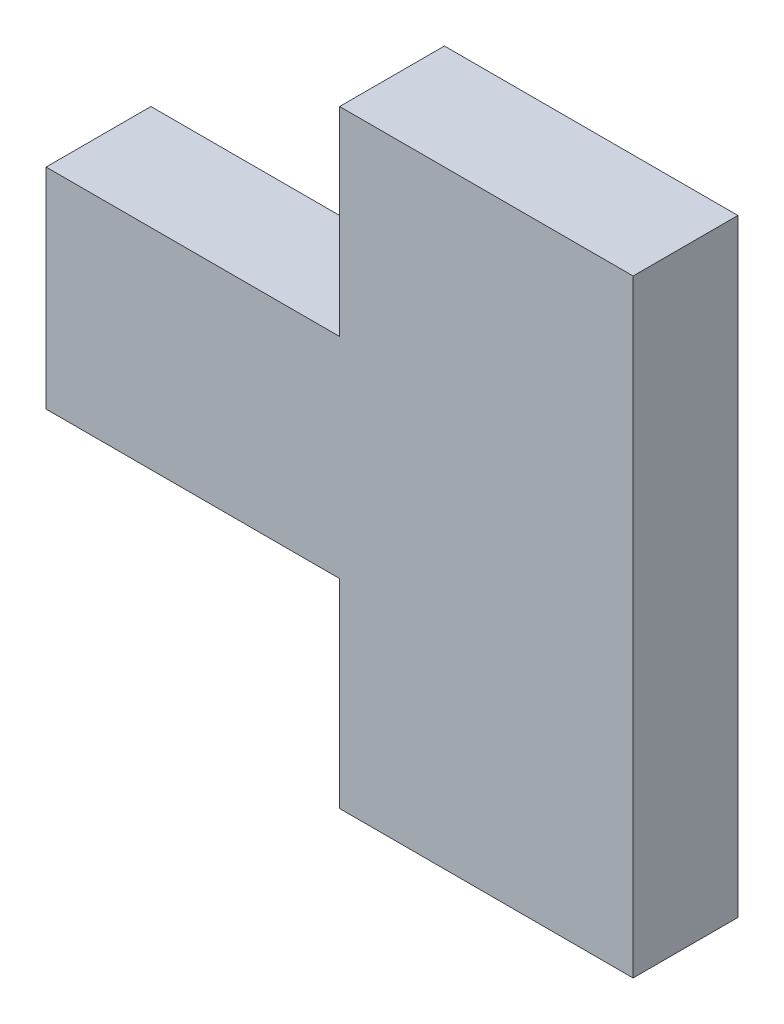
ISO-10303-21;
HEADER;
FILE_DESCRIPTION(('STEP AP214'),'2;1');
FILE_NAME('part.step','',(''),(''),'','','');
FILE_SCHEMA(('AUTOMOTIVE_DESIGN { 1 0 10303 214 1 1 1 1 }'));
ENDSEC;
DATA;
#1=APPLICATION_CONTEXT('core data for automotive mechanical design processes');
#2=APPLICATION_PROTOCOL_DEFINITION('international standard','automotive_design',2000,#1);
#3=PRODUCT_CONTEXT('',#1,'mechanical');
#4=PRODUCT('Part','Part','',(#3));
#5=PRODUCT_RELATED_PRODUCT_CATEGORY('part','',(#4));
#6=PRODUCT_DEFINITION_FORMATION('','',#4);
#7=PRODUCT_DEFINITION_CONTEXT('part definition',#1,'design');
#8=PRODUCT_DEFINITION('design','',#6,#7);
#9=PRODUCT_DEFINITION_SHAPE('','',#8);
#10=(LENGTH_UNIT() NAMED_UNIT(*) SI_UNIT(.MILLI.,.METRE.));
#11=(NAMED_UNIT(*) PLANE_ANGLE_UNIT() SI_UNIT($,.RADIAN.));
#12=(NAMED_UNIT(*) SI_UNIT($,.STERADIAN.) SOLID_ANGLE_UNIT());
#13=UNCERTAINTY_MEASURE_WITH_UNIT(LENGTH_MEASURE(1.E-05),#10,'distance_accuracy_value','');
#14=(GEOMETRIC_REPRESENTATION_CONTEXT(3) GLOBAL_UNCERTAINTY_ASSIGNED_CONTEXT((#13)) GLOBAL_UNIT_ASSIGNED_CONTEXT((#10,
#11,#12)) REPRESENTATION_CONTEXT('',''));
#15=CARTESIAN_POINT('',(0.,0.,0.));
#16=DIRECTION('',(0.,0.,1.));
#17=DIRECTION('',(1.,0.,0.));
#18=AXIS2_PLACEMENT_3D('',#15,#16,#17);
#19=CARTESIAN_POINT('',(-1.39999974,0.50000154,0.5));
#20=DIRECTION('',(0.,0.,-1.));
#21=DIRECTION('',(-1.,0.,0.));
#22=AXIS2_PLACEMENT_3D('',#19,#20,#21);
#23=PLANE('',#22);
#24=DIRECTION('',(-1.,0.,0.));
#25=VECTOR('',#24,1.);
#26=CARTESIAN_POINT('',(-1.39999974,-0.499999,0.5));
#27=LINE('',#26,#25);
#28=CARTESIAN_POINT('',(2.54000000051292E-06,-0.499999,0.5));
#29=VERTEX_POINT('',#28);
#30=CARTESIAN_POINT('',(-1.39999974,-0.499999,0.5));
#31=VERTEX_POINT('',#30);
#32=EDGE_CURVE('E102',#29,#31,#27,.T.);
#33=ORIENTED_EDGE('',*,*,#32,.F.);
#34=DIRECTION('',(0.,1.,0.));
#35=VECTOR('',#34,1.);
#36=CARTESIAN_POINT('',(2.54000000047584E-06,0.50000154,0.5));
#37=LINE('',#36,#35);
#38=CARTESIAN_POINT('',(2.54000000049438E-06,-1.44999964,0.5));
#39=VERTEX_POINT('',#38);
#40=EDGE_CURVE('E79',#39,#29,#37,.T.);
#41=ORIENTED_EDGE('',*,*,#40,.F.);
#42=DIRECTION('',(-1.,0.,0.));
#43=VECTOR('',#42,1.);
#44=CARTESIAN_POINT('',(-1.39999974,-1.44999964,0.5));
#45=LINE('',#44,#43);
#46=CARTESIAN_POINT('',(1.39999974,-1.44999964,0.5));
#47=VERTEX_POINT('',#46);
#48=EDGE_CURVE('E19',#47,#39,#45,.T.);
#49=ORIENTED_EDGE('',*,*,#48,.F.);
#50=DIRECTION('',(0.,1.,0.));
#51=VECTOR('',#50,1.);
#52=CARTESIAN_POINT('',(1.39999974,1.45000218,0.5));
#53=LINE('',#52,#51);
#54=CARTESIAN_POINT('',(1.39999974,1.45000218,0.5));
#55=VERTEX_POINT('',#54);
#56=EDGE_CURVE('E135',#55,#47,#53,.F.);
#57=ORIENTED_EDGE('',*,*,#56,.F.);
#58=DIRECTION('',(1.,0.,0.));
#59=VECTOR('',#58,1.);
#60=CARTESIAN_POINT('',(2.54000000055E-06,1.45000218,0.5));
#61=LINE('',#60,#59);
#62=CARTESIAN_POINT('',(2.54000000053146E-06,1.45000218,0.5));
#63=VERTEX_POINT('',#62);
#64=EDGE_CURVE('E128',#63,#55,#61,.T.);
#65=ORIENTED_EDGE('',*,*,#64,.F.);
#66=DIRECTION('',(0.,1.,0.));
#67=VECTOR('',#66,1.);
#68=CARTESIAN_POINT('',(2.54000000055E-06,0.50000154,0.5));
#69=LINE('',#68,#67);
#70=CARTESIAN_POINT('',(2.54000000049438E-06,0.50000154,0.5));
#71=VERTEX_POINT('',#70);
#72=EDGE_CURVE('E121',#71,#63,#69,.T.);
#73=ORIENTED_EDGE('',*,*,#72,.F.);
#74=DIRECTION('',(1.,0.,0.));
#75=VECTOR('',#74,1.);
#76=CARTESIAN_POINT('',(-1.39999974,0.50000154,0.5));
#77=LINE('',#76,#75);
#78=CARTESIAN_POINT('',(-1.39999974,0.50000154,0.5));
#79=VERTEX_POINT('',#78);
#80=EDGE_CURVE('E114',#79,#71,#77,.T.);
#81=ORIENTED_EDGE('',*,*,#80,.F.);
#82=DIRECTION('',(0.,1.,0.));
#83=VECTOR('',#82,1.);
#84=CARTESIAN_POINT('',(-1.39999974,0.50000154,0.5));
#85=LINE('',#84,#83);
#86=EDGE_CURVE('E109',#31,#79,#85,.T.);
#87=ORIENTED_EDGE('',*,*,#86,.F.);
#88=EDGE_LOOP('',(#33,#41,#49,#57,#65,#73,#81,#87));
#89=FACE_BOUND('',#88,.T.);
#90=ADVANCED_FACE('F16',(#89),#23,.F.);
#91=CARTESIAN_POINT('',(-1.39999974,0.50000154,0.));
#92=DIRECTION('',(0.,1.,0.));
#93=DIRECTION('',(0.,0.,1.));
#94=AXIS2_PLACEMENT_3D('',#91,#92,#93);
#95=PLANE('',#94);
#96=DIRECTION('',(0.,0.,1.));
#97=VECTOR('',#96,1.);
#98=CARTESIAN_POINT('',(2.54000000055E-06,0.50000154,0.));
#99=LINE('',#98,#97);
#100=CARTESIAN_POINT('',(2.54000000049438E-06,0.50000154,0.));
#101=VERTEX_POINT('',#100);
#102=EDGE_CURVE('E117',#101,#71,#99,.T.);
#103=ORIENTED_EDGE('',*,*,#102,.F.);
#104=DIRECTION('',(-1.,0.,0.));
#105=VECTOR('',#104,1.);
#106=CARTESIAN_POINT('',(-1.39999974,0.50000154,0.));
#107=LINE('',#106,#105);
#108=CARTESIAN_POINT('',(-1.39999974,0.50000154,0.));
#109=VERTEX_POINT('',#108);
#110=EDGE_CURVE('E147',#109,#101,#107,.F.);
#111=ORIENTED_EDGE('',*,*,#110,.F.);
#112=DIRECTION('',(0.,0.,1.));
#113=VECTOR('',#112,1.);
#114=CARTESIAN_POINT('',(-1.39999974,0.50000154,0.));
#115=LINE('',#114,#113);
#116=EDGE_CURVE('E143',#79,#109,#115,.F.);
#117=ORIENTED_EDGE('',*,*,#116,.F.);
#118=ORIENTED_EDGE('',*,*,#80,.T.);
#119=EDGE_LOOP('',(#103,#111,#117,#118));
#120=FACE_BOUND('',#119,.T.);
#121=ADVANCED_FACE('F180',(#120),#95,.T.);
#122=CARTESIAN_POINT('',(2.54000000055E-06,0.50000154,0.));
#123=DIRECTION('',(-1.,0.,0.));
#124=DIRECTION('',(0.,0.,1.));
#125=AXIS2_PLACEMENT_3D('',#122,#123,#124);
#126=PLANE('',#125);
#127=DIRECTION('',(0.,0.,1.));
#128=VECTOR('',#127,1.);
#129=CARTESIAN_POINT('',(2.54000000055E-06,1.45000218,0.));
#130=LINE('',#129,#128);
#131=CARTESIAN_POINT('',(2.54000000053146E-06,1.45000218,0.));
#132=VERTEX_POINT('',#131);
#133=EDGE_CURVE('E124',#132,#63,#130,.T.);
#134=ORIENTED_EDGE('',*,*,#133,.F.);
#135=DIRECTION('',(0.,1.,0.));
#136=VECTOR('',#135,1.);
#137=CARTESIAN_POINT('',(2.54000000047584E-06,0.50000154,0.));
#138=LINE('',#137,#136);
#139=EDGE_CURVE('E151',#101,#132,#138,.T.);
#140=ORIENTED_EDGE('',*,*,#139,.F.);
#141=ORIENTED_EDGE('',*,*,#102,.T.);
#142=ORIENTED_EDGE('',*,*,#72,.T.);
#143=EDGE_LOOP('',(#134,#140,#141,#142));
#144=FACE_BOUND('',#143,.T.);
#145=ADVANCED_FACE('F184',(#144),#126,.T.);
#146=CARTESIAN_POINT('',(2.54000000055E-06,1.45000218,0.));
#147=DIRECTION('',(0.,1.,0.));
#148=DIRECTION('',(0.,0.,1.));
#149=AXIS2_PLACEMENT_3D('',#146,#147,#148);
#150=PLANE('',#149);
#151=DIRECTION('',(0.,0.,-1.));
#152=VECTOR('',#151,1.);
#153=CARTESIAN_POINT('',(1.39999974,1.45000218,0.));
#154=LINE('',#153,#152);
#155=CARTESIAN_POINT('',(1.39999974,1.45000218,0.));
#156=VERTEX_POINT('',#155);
#157=EDGE_CURVE('E131',#156,#55,#154,.F.);
#158=ORIENTED_EDGE('',*,*,#157,.F.);
#159=DIRECTION('',(-1.,0.,0.));
#160=VECTOR('',#159,1.);
#161=CARTESIAN_POINT('',(-1.39999974,1.45000218,0.));
#162=LINE('',#161,#160);
#163=EDGE_CURVE('E155',#132,#156,#162,.F.);
#164=ORIENTED_EDGE('',*,*,#163,.F.);
#165=ORIENTED_EDGE('',*,*,#133,.T.);
#166=ORIENTED_EDGE('',*,*,#64,.T.);
#167=EDGE_LOOP('',(#158,#164,#165,#166));
#168=FACE_BOUND('',#167,.T.);
#169=ADVANCED_FACE('F186',(#168),#150,.T.);
#170=CARTESIAN_POINT('',(1.39999974,1.45000218,0.));
#171=DIRECTION('',(1.,0.,0.));
#172=DIRECTION('',(0.,0.,-1.));
#173=AXIS2_PLACEMENT_3D('',#170,#171,#172);
#174=PLANE('',#173);
#175=DIRECTION('',(0.,0.,-1.));
#176=VECTOR('',#175,1.);
#177=CARTESIAN_POINT('',(1.39999974,-1.44999964,0.));
#178=LINE('',#177,#176);
#179=CARTESIAN_POINT('',(1.39999974,-1.44999964,0.));
#180=VERTEX_POINT('',#179);
#181=EDGE_CURVE('E88',#180,#47,#178,.F.);
#182=ORIENTED_EDGE('',*,*,#181,.F.);
#183=DIRECTION('',(0.,1.,0.));
#184=VECTOR('',#183,1.);
#185=CARTESIAN_POINT('',(1.39999974,0.50000154,0.));
#186=LINE('',#185,#184);
#187=EDGE_CURVE('E159',#156,#180,#186,.F.);
#188=ORIENTED_EDGE('',*,*,#187,.F.);
#189=ORIENTED_EDGE('',*,*,#157,.T.);
#190=ORIENTED_EDGE('',*,*,#56,.T.);
#191=EDGE_LOOP('',(#182,#188,#189,#190));
#192=FACE_BOUND('',#191,.T.);
#193=ADVANCED_FACE('F189',(#192),#174,.T.);
#194=CARTESIAN_POINT('',(1.39999974,-1.44999964,0.));
#195=DIRECTION('',(0.,-1.,0.));
#196=DIRECTION('',(0.,0.,-1.));
#197=AXIS2_PLACEMENT_3D('',#194,#195,#196);
#198=PLANE('',#197);
#199=DIRECTION('',(0.,0.,1.));
#200=VECTOR('',#199,1.);
#201=CARTESIAN_POINT('',(2.54000000055E-06,-1.44999964,0.));
#202=LINE('',#201,#200);
#203=CARTESIAN_POINT('',(2.54000000049438E-06,-1.44999964,0.));
#204=VERTEX_POINT('',#203);
#205=EDGE_CURVE('E86',#204,#39,#202,.T.);
#206=ORIENTED_EDGE('',*,*,#205,.F.);
#207=DIRECTION('',(-1.,0.,0.));
#208=VECTOR('',#207,1.);
#209=CARTESIAN_POINT('',(-1.39999974,-1.44999964,0.));
#210=LINE('',#209,#208);
#211=EDGE_CURVE('E162',#180,#204,#210,.T.);
#212=ORIENTED_EDGE('',*,*,#211,.F.);
#213=ORIENTED_EDGE('',*,*,#181,.T.);
#214=ORIENTED_EDGE('',*,*,#48,.T.);
#215=EDGE_LOOP('',(#206,#212,#213,#214));
#216=FACE_BOUND('',#215,.T.);
#217=ADVANCED_FACE('F84',(#216),#198,.T.);
#218=CARTESIAN_POINT('',(2.54000000055E-06,-1.44999964,0.));
#219=DIRECTION('',(-1.,0.,0.));
#220=DIRECTION('',(0.,0.,1.));
#221=AXIS2_PLACEMENT_3D('',#218,#219,#220);
#222=PLANE('',#221);
#223=DIRECTION('',(0.,0.,-1.));
#224=VECTOR('',#223,1.);
#225=CARTESIAN_POINT('',(2.54000000055E-06,-0.499999,0.));
#226=LINE('',#225,#224);
#227=CARTESIAN_POINT('',(2.54000000053146E-06,-0.499999,0.));
#228=VERTEX_POINT('',#227);
#229=EDGE_CURVE('E98',#228,#29,#226,.F.);
#230=ORIENTED_EDGE('',*,*,#229,.F.);
#231=DIRECTION('',(0.,1.,0.));
#232=VECTOR('',#231,1.);
#233=CARTESIAN_POINT('',(2.54000000047584E-06,0.50000154,0.));
#234=LINE('',#233,#232);
#235=EDGE_CURVE('E95',#204,#228,#234,.T.);
#236=ORIENTED_EDGE('',*,*,#235,.F.);
#237=ORIENTED_EDGE('',*,*,#205,.T.);
#238=ORIENTED_EDGE('',*,*,#40,.T.);
#239=EDGE_LOOP('',(#230,#236,#237,#238));
#240=FACE_BOUND('',#239,.T.);
#241=ADVANCED_FACE('F93',(#240),#222,.T.);
#242=CARTESIAN_POINT('',(2.54000000055E-06,-0.499999,0.));
#243=DIRECTION('',(0.,-1.,0.));
#244=DIRECTION('',(0.,0.,-1.));
#245=AXIS2_PLACEMENT_3D('',#242,#243,#244);
#246=PLANE('',#245);
#247=DIRECTION('',(0.,0.,1.));
#248=VECTOR('',#247,1.);
#249=CARTESIAN_POINT('',(-1.39999974,-0.499999,0.));
#250=LINE('',#249,#248);
#251=CARTESIAN_POINT('',(-1.39999974,-0.499999,0.));
#252=VERTEX_POINT('',#251);
#253=EDGE_CURVE('E35',#252,#31,#250,.T.);
#254=ORIENTED_EDGE('',*,*,#253,.F.);
#255=DIRECTION('',(-1.,0.,0.));
#256=VECTOR('',#255,1.);
#257=CARTESIAN_POINT('',(-1.39999974,-0.499999,0.));
#258=LINE('',#257,#256);
#259=EDGE_CURVE('E26',#228,#252,#258,.T.);
#260=ORIENTED_EDGE('',*,*,#259,.F.);
#261=ORIENTED_EDGE('',*,*,#229,.T.);
#262=ORIENTED_EDGE('',*,*,#32,.T.);
#263=EDGE_LOOP('',(#254,#260,#261,#262));
#264=FACE_BOUND('',#263,.T.);
#265=ADVANCED_FACE('F172',(#264),#246,.T.);
#266=CARTESIAN_POINT('',(-1.39999974,-0.499999,0.));
#267=DIRECTION('',(-1.,0.,0.));
#268=DIRECTION('',(0.,0.,1.));
#269=AXIS2_PLACEMENT_3D('',#266,#267,#268);
#270=PLANE('',#269);
#271=ORIENTED_EDGE('',*,*,#116,.T.);
#272=DIRECTION('',(0.,1.,0.));
#273=VECTOR('',#272,1.);
#274=CARTESIAN_POINT('',(-1.39999974,0.50000154,0.));
#275=LINE('',#274,#273);
#276=EDGE_CURVE('E11',#252,#109,#275,.T.);
#277=ORIENTED_EDGE('',*,*,#276,.F.);
#278=ORIENTED_EDGE('',*,*,#253,.T.);
#279=ORIENTED_EDGE('',*,*,#86,.T.);
#280=EDGE_LOOP('',(#271,#277,#278,#279));
#281=FACE_BOUND('',#280,.T.);
#282=ADVANCED_FACE('F174',(#281),#270,.T.);
#283=CARTESIAN_POINT('',(-1.39999974,0.50000154,0.));
#284=DIRECTION('',(0.,0.,-1.));
#285=DIRECTION('',(-1.,0.,0.));
#286=AXIS2_PLACEMENT_3D('',#283,#284,#285);
#287=PLANE('',#286);
#288=ORIENTED_EDGE('',*,*,#259,.T.);
#289=ORIENTED_EDGE('',*,*,#276,.T.);
#290=ORIENTED_EDGE('',*,*,#110,.T.);
#291=ORIENTED_EDGE('',*,*,#139,.T.);
#292=ORIENTED_EDGE('',*,*,#163,.T.);
#293=ORIENTED_EDGE('',*,*,#187,.T.);
#294=ORIENTED_EDGE('',*,*,#211,.T.);
#295=ORIENTED_EDGE('',*,*,#235,.T.);
#296=EDGE_LOOP('',(#288,#289,#290,#291,#292,#293,#294,#295));
#297=FACE_BOUND('',#296,.T.);
#298=ADVANCED_FACE('F171',(#297),#287,.T.);
#299=CLOSED_SHELL('',(#90,#121,#145,#169,#193,#217,#241,#265,#282,#298));
#300=MANIFOLD_SOLID_BREP('B1',#299);
#301=ADVANCED_BREP_SHAPE_REPRESENTATION('',(#18,#300),#14);
#302=SHAPE_DEFINITION_REPRESENTATION(#9,#301);
ENDSEC;
END-ISO-10303-21;
